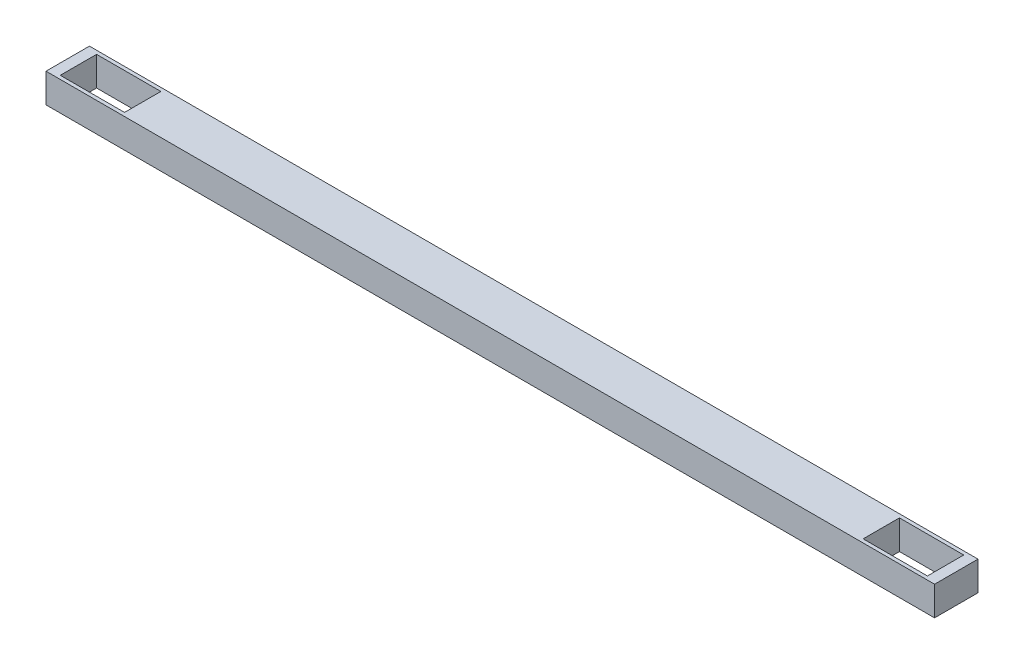
ISO-10303-21;
HEADER;
FILE_DESCRIPTION(('STEP AP214'),'2;1');
FILE_NAME('part.step','',(''),(''),'','','');
FILE_SCHEMA(('AUTOMOTIVE_DESIGN { 1 0 10303 214 1 1 1 1 }'));
ENDSEC;
DATA;
#1=APPLICATION_CONTEXT('core data for automotive mechanical design processes');
#2=APPLICATION_PROTOCOL_DEFINITION('international standard','automotive_design',2000,#1);
#3=PRODUCT_CONTEXT('',#1,'mechanical');
#4=PRODUCT('Part','Part','',(#3));
#5=PRODUCT_RELATED_PRODUCT_CATEGORY('part','',(#4));
#6=PRODUCT_DEFINITION_FORMATION('','',#4);
#7=PRODUCT_DEFINITION_CONTEXT('part definition',#1,'design');
#8=PRODUCT_DEFINITION('design','',#6,#7);
#9=PRODUCT_DEFINITION_SHAPE('','',#8);
#10=(LENGTH_UNIT() NAMED_UNIT(*) SI_UNIT(.MILLI.,.METRE.));
#11=(NAMED_UNIT(*) PLANE_ANGLE_UNIT() SI_UNIT($,.RADIAN.));
#12=(NAMED_UNIT(*) SI_UNIT($,.STERADIAN.) SOLID_ANGLE_UNIT());
#13=UNCERTAINTY_MEASURE_WITH_UNIT(LENGTH_MEASURE(1.E-05),#10,'distance_accuracy_value','');
#14=(GEOMETRIC_REPRESENTATION_CONTEXT(3) GLOBAL_UNCERTAINTY_ASSIGNED_CONTEXT((#13)) GLOBAL_UNIT_ASSIGNED_CONTEXT((#10,
#11,#12)) REPRESENTATION_CONTEXT('',''));
#15=CARTESIAN_POINT('',(0.,0.,0.));
#16=DIRECTION('',(0.,0.,1.));
#17=DIRECTION('',(1.,0.,0.));
#18=AXIS2_PLACEMENT_3D('',#15,#16,#17);
#19=CARTESIAN_POINT('',(0.,360.235,0.));
#20=DIRECTION('',(0.,1.,0.));
#21=DIRECTION('',(0.,0.,1.));
#22=AXIS2_PLACEMENT_3D('',#19,#20,#21);
#23=PLANE('',#22);
#24=DIRECTION('',(0.,0.,-1.));
#25=VECTOR('',#24,1.);
#26=CARTESIAN_POINT('',(311.625,360.235,-26.7500000000001));
#27=LINE('',#26,#25);
#28=CARTESIAN_POINT('',(311.625,360.235,-26.7500000000001));
#29=VERTEX_POINT('',#28);
#30=CARTESIAN_POINT('',(311.625,360.235,-57.2200000000001));
#31=VERTEX_POINT('',#30);
#32=EDGE_CURVE('E192',#29,#31,#27,.T.);
#33=ORIENTED_EDGE('',*,*,#32,.T.);
#34=DIRECTION('',(-1.,0.,0.));
#35=VECTOR('',#34,1.);
#36=CARTESIAN_POINT('',(311.625,360.235,-57.2200000000001));
#37=LINE('',#36,#35);
#38=CARTESIAN_POINT('',(-311.625,360.235,-57.22));
#39=VERTEX_POINT('',#38);
#40=EDGE_CURVE('E195',#31,#39,#37,.T.);
#41=ORIENTED_EDGE('',*,*,#40,.T.);
#42=DIRECTION('',(0.,0.,1.));
#43=VECTOR('',#42,1.);
#44=CARTESIAN_POINT('',(-311.625,360.235,-26.75));
#45=LINE('',#44,#43);
#46=CARTESIAN_POINT('',(-311.625,360.235,-26.75));
#47=VERTEX_POINT('',#46);
#48=EDGE_CURVE('E198',#39,#47,#45,.T.);
#49=ORIENTED_EDGE('',*,*,#48,.T.);
#50=DIRECTION('',(1.,0.,0.));
#51=VECTOR('',#50,1.);
#52=CARTESIAN_POINT('',(311.625,360.235,-26.7500000000001));
#53=LINE('',#52,#51);
#54=EDGE_CURVE('E200',#47,#29,#53,.T.);
#55=ORIENTED_EDGE('',*,*,#54,.T.);
#56=EDGE_LOOP('',(#33,#41,#49,#55));
#57=FACE_BOUND('',#56,.T.);
#58=DIRECTION('',(1.,0.,0.));
#59=VECTOR('',#58,1.);
#60=CARTESIAN_POINT('',(304.125,360.235,-29.2500000000002));
#61=LINE('',#60,#59);
#62=CARTESIAN_POINT('',(259.025,360.235,-29.2500000000002));
#63=VERTEX_POINT('',#62);
#64=CARTESIAN_POINT('',(304.125,360.235,-29.2500000000002));
#65=VERTEX_POINT('',#64);
#66=EDGE_CURVE('E163',#63,#65,#61,.T.);
#67=ORIENTED_EDGE('',*,*,#66,.F.);
#68=DIRECTION('',(0.,0.,1.));
#69=VECTOR('',#68,1.);
#70=CARTESIAN_POINT('',(259.025,360.235,-54.72));
#71=LINE('',#70,#69);
#72=CARTESIAN_POINT('',(259.025,360.235,-54.72));
#73=VERTEX_POINT('',#72);
#74=EDGE_CURVE('E161',#73,#63,#71,.T.);
#75=ORIENTED_EDGE('',*,*,#74,.F.);
#76=DIRECTION('',(-1.,0.,0.));
#77=VECTOR('',#76,1.);
#78=CARTESIAN_POINT('',(304.125,360.235,-54.72));
#79=LINE('',#78,#77);
#80=CARTESIAN_POINT('',(304.125,360.235,-54.72));
#81=VERTEX_POINT('',#80);
#82=EDGE_CURVE('E169',#81,#73,#79,.T.);
#83=ORIENTED_EDGE('',*,*,#82,.F.);
#84=DIRECTION('',(0.,0.,-1.));
#85=VECTOR('',#84,1.);
#86=CARTESIAN_POINT('',(304.125,360.235,-54.72));
#87=LINE('',#86,#85);
#88=EDGE_CURVE('E166',#65,#81,#87,.T.);
#89=ORIENTED_EDGE('',*,*,#88,.F.);
#90=EDGE_LOOP('',(#67,#75,#83,#89));
#91=FACE_BOUND('',#90,.T.);
#92=DIRECTION('',(1.,0.,0.));
#93=VECTOR('',#92,1.);
#94=CARTESIAN_POINT('',(-259.025,360.235,-29.2500000000001));
#95=LINE('',#94,#93);
#96=CARTESIAN_POINT('',(-304.125,360.235,-29.25));
#97=VERTEX_POINT('',#96);
#98=CARTESIAN_POINT('',(-259.025,360.235,-29.2500000000001));
#99=VERTEX_POINT('',#98);
#100=EDGE_CURVE('E133',#97,#99,#95,.T.);
#101=ORIENTED_EDGE('',*,*,#100,.F.);
#102=DIRECTION('',(0.,0.,1.));
#103=VECTOR('',#102,1.);
#104=CARTESIAN_POINT('',(-304.125,360.235,-29.25));
#105=LINE('',#104,#103);
#106=CARTESIAN_POINT('',(-304.125,360.235,-54.7199999999999));
#107=VERTEX_POINT('',#106);
#108=EDGE_CURVE('E125',#107,#97,#105,.T.);
#109=ORIENTED_EDGE('',*,*,#108,.F.);
#110=DIRECTION('',(-1.,0.,0.));
#111=VECTOR('',#110,1.);
#112=CARTESIAN_POINT('',(-259.025,360.235,-54.7199999999999));
#113=LINE('',#112,#111);
#114=CARTESIAN_POINT('',(-259.025,360.235,-54.7199999999999));
#115=VERTEX_POINT('',#114);
#116=EDGE_CURVE('E147',#115,#107,#113,.T.);
#117=ORIENTED_EDGE('',*,*,#116,.F.);
#118=DIRECTION('',(0.,0.,-1.));
#119=VECTOR('',#118,1.);
#120=CARTESIAN_POINT('',(-259.025,360.235,-29.2500000000001));
#121=LINE('',#120,#119);
#122=EDGE_CURVE('E145',#99,#115,#121,.T.);
#123=ORIENTED_EDGE('',*,*,#122,.F.);
#124=EDGE_LOOP('',(#101,#109,#117,#123));
#125=FACE_BOUND('',#124,.T.);
#126=ADVANCED_FACE('F36',(#57,#91,#125),#23,.T.);
#127=CARTESIAN_POINT('',(0.,339.765,0.));
#128=DIRECTION('',(0.,1.,0.));
#129=DIRECTION('',(0.,0.,1.));
#130=AXIS2_PLACEMENT_3D('',#127,#128,#129);
#131=PLANE('',#130);
#132=DIRECTION('',(0.,0.,1.));
#133=VECTOR('',#132,1.);
#134=CARTESIAN_POINT('',(259.025,339.765,-54.72));
#135=LINE('',#134,#133);
#136=CARTESIAN_POINT('',(259.025,339.765,-54.72));
#137=VERTEX_POINT('',#136);
#138=CARTESIAN_POINT('',(259.025,339.765,-29.2500000000002));
#139=VERTEX_POINT('',#138);
#140=EDGE_CURVE('E141',#137,#139,#135,.T.);
#141=ORIENTED_EDGE('',*,*,#140,.T.);
#142=DIRECTION('',(1.,0.,0.));
#143=VECTOR('',#142,1.);
#144=CARTESIAN_POINT('',(304.125,339.765,-29.2500000000002));
#145=LINE('',#144,#143);
#146=CARTESIAN_POINT('',(304.125,339.765,-29.2500000000002));
#147=VERTEX_POINT('',#146);
#148=EDGE_CURVE('E174',#139,#147,#145,.T.);
#149=ORIENTED_EDGE('',*,*,#148,.T.);
#150=DIRECTION('',(0.,0.,-1.));
#151=VECTOR('',#150,1.);
#152=CARTESIAN_POINT('',(304.125,339.765,-54.72));
#153=LINE('',#152,#151);
#154=CARTESIAN_POINT('',(304.125,339.765,-54.72));
#155=VERTEX_POINT('',#154);
#156=EDGE_CURVE('E177',#147,#155,#153,.T.);
#157=ORIENTED_EDGE('',*,*,#156,.T.);
#158=DIRECTION('',(-1.,0.,0.));
#159=VECTOR('',#158,1.);
#160=CARTESIAN_POINT('',(304.125,339.765,-54.72));
#161=LINE('',#160,#159);
#162=EDGE_CURVE('E164',#155,#137,#161,.T.);
#163=ORIENTED_EDGE('',*,*,#162,.T.);
#164=EDGE_LOOP('',(#141,#149,#157,#163));
#165=FACE_BOUND('',#164,.T.);
#166=DIRECTION('',(0.,0.,-1.));
#167=VECTOR('',#166,1.);
#168=CARTESIAN_POINT('',(311.625,339.765,-26.7500000000001));
#169=LINE('',#168,#167);
#170=CARTESIAN_POINT('',(311.625,339.765,-26.7500000000001));
#171=VERTEX_POINT('',#170);
#172=CARTESIAN_POINT('',(311.625,339.765,-57.2200000000001));
#173=VERTEX_POINT('',#172);
#174=EDGE_CURVE('E191',#171,#173,#169,.T.);
#175=ORIENTED_EDGE('',*,*,#174,.F.);
#176=DIRECTION('',(1.,0.,0.));
#177=VECTOR('',#176,1.);
#178=CARTESIAN_POINT('',(311.625,339.765,-26.7500000000001));
#179=LINE('',#178,#177);
#180=CARTESIAN_POINT('',(-311.625,339.765,-26.75));
#181=VERTEX_POINT('',#180);
#182=EDGE_CURVE('E196',#181,#171,#179,.T.);
#183=ORIENTED_EDGE('',*,*,#182,.F.);
#184=DIRECTION('',(0.,0.,1.));
#185=VECTOR('',#184,1.);
#186=CARTESIAN_POINT('',(-311.625,339.765,-26.75));
#187=LINE('',#186,#185);
#188=CARTESIAN_POINT('',(-311.625,339.765,-57.22));
#189=VERTEX_POINT('',#188);
#190=EDGE_CURVE('E207',#189,#181,#187,.T.);
#191=ORIENTED_EDGE('',*,*,#190,.F.);
#192=DIRECTION('',(-1.,0.,0.));
#193=VECTOR('',#192,1.);
#194=CARTESIAN_POINT('',(311.625,339.765,-57.2200000000001));
#195=LINE('',#194,#193);
#196=EDGE_CURVE('E205',#173,#189,#195,.T.);
#197=ORIENTED_EDGE('',*,*,#196,.F.);
#198=EDGE_LOOP('',(#175,#183,#191,#197));
#199=FACE_BOUND('',#198,.T.);
#200=DIRECTION('',(0.,0.,1.));
#201=VECTOR('',#200,1.);
#202=CARTESIAN_POINT('',(-304.125,339.765,-29.25));
#203=LINE('',#202,#201);
#204=CARTESIAN_POINT('',(-304.125,339.765,-54.7199999999999));
#205=VERTEX_POINT('',#204);
#206=CARTESIAN_POINT('',(-304.125,339.765,-29.25));
#207=VERTEX_POINT('',#206);
#208=EDGE_CURVE('E59',#205,#207,#203,.T.);
#209=ORIENTED_EDGE('',*,*,#208,.T.);
#210=DIRECTION('',(1.,0.,0.));
#211=VECTOR('',#210,1.);
#212=CARTESIAN_POINT('',(-259.025,339.765,-29.2500000000001));
#213=LINE('',#212,#211);
#214=CARTESIAN_POINT('',(-259.025,339.765,-29.2500000000001));
#215=VERTEX_POINT('',#214);
#216=EDGE_CURVE('E140',#207,#215,#213,.T.);
#217=ORIENTED_EDGE('',*,*,#216,.T.);
#218=DIRECTION('',(0.,0.,-1.));
#219=VECTOR('',#218,1.);
#220=CARTESIAN_POINT('',(-259.025,339.765,-29.2500000000001));
#221=LINE('',#220,#219);
#222=CARTESIAN_POINT('',(-259.025,339.765,-54.7199999999999));
#223=VERTEX_POINT('',#222);
#224=EDGE_CURVE('E153',#215,#223,#221,.T.);
#225=ORIENTED_EDGE('',*,*,#224,.T.);
#226=DIRECTION('',(-1.,0.,0.));
#227=VECTOR('',#226,1.);
#228=CARTESIAN_POINT('',(-259.025,339.765,-54.7199999999999));
#229=LINE('',#228,#227);
#230=EDGE_CURVE('E134',#223,#205,#229,.T.);
#231=ORIENTED_EDGE('',*,*,#230,.T.);
#232=EDGE_LOOP('',(#209,#217,#225,#231));
#233=FACE_BOUND('',#232,.T.);
#234=ADVANCED_FACE('F225',(#165,#199,#233),#131,.F.);
#235=CARTESIAN_POINT('',(311.625,360.235,-26.7500000000001));
#236=DIRECTION('',(-1.,0.,0.));
#237=DIRECTION('',(0.,0.,1.));
#238=AXIS2_PLACEMENT_3D('',#235,#236,#237);
#239=PLANE('',#238);
#240=ORIENTED_EDGE('',*,*,#174,.T.);
#241=DIRECTION('',(0.,-1.,0.));
#242=VECTOR('',#241,1.);
#243=CARTESIAN_POINT('',(311.625,360.235,-57.2200000000001));
#244=LINE('',#243,#242);
#245=EDGE_CURVE('E11',#31,#173,#244,.T.);
#246=ORIENTED_EDGE('',*,*,#245,.F.);
#247=ORIENTED_EDGE('',*,*,#32,.F.);
#248=DIRECTION('',(0.,-1.,0.));
#249=VECTOR('',#248,1.);
#250=CARTESIAN_POINT('',(311.625,360.235,-26.7500000000001));
#251=LINE('',#250,#249);
#252=EDGE_CURVE('E202',#29,#171,#251,.T.);
#253=ORIENTED_EDGE('',*,*,#252,.T.);
#254=EDGE_LOOP('',(#240,#246,#247,#253));
#255=FACE_BOUND('',#254,.T.);
#256=ADVANCED_FACE('F38',(#255),#239,.F.);
#257=CARTESIAN_POINT('',(311.625,360.235,-57.2200000000001));
#258=DIRECTION('',(0.,0.,1.));
#259=DIRECTION('',(1.,0.,0.));
#260=AXIS2_PLACEMENT_3D('',#257,#258,#259);
#261=PLANE('',#260);
#262=ORIENTED_EDGE('',*,*,#196,.T.);
#263=DIRECTION('',(0.,-1.,0.));
#264=VECTOR('',#263,1.);
#265=CARTESIAN_POINT('',(-311.625,360.235,-57.22));
#266=LINE('',#265,#264);
#267=EDGE_CURVE('E44',#39,#189,#266,.T.);
#268=ORIENTED_EDGE('',*,*,#267,.F.);
#269=ORIENTED_EDGE('',*,*,#40,.F.);
#270=ORIENTED_EDGE('',*,*,#245,.T.);
#271=EDGE_LOOP('',(#262,#268,#269,#270));
#272=FACE_BOUND('',#271,.T.);
#273=ADVANCED_FACE('F236',(#272),#261,.F.);
#274=CARTESIAN_POINT('',(-311.625,360.235,-26.75));
#275=DIRECTION('',(1.,0.,0.));
#276=DIRECTION('',(0.,0.,-1.));
#277=AXIS2_PLACEMENT_3D('',#274,#275,#276);
#278=PLANE('',#277);
#279=ORIENTED_EDGE('',*,*,#190,.T.);
#280=DIRECTION('',(0.,-1.,0.));
#281=VECTOR('',#280,1.);
#282=CARTESIAN_POINT('',(-311.625,360.235,-26.75));
#283=LINE('',#282,#281);
#284=EDGE_CURVE('E212',#47,#181,#283,.T.);
#285=ORIENTED_EDGE('',*,*,#284,.F.);
#286=ORIENTED_EDGE('',*,*,#48,.F.);
#287=ORIENTED_EDGE('',*,*,#267,.T.);
#288=EDGE_LOOP('',(#279,#285,#286,#287));
#289=FACE_BOUND('',#288,.T.);
#290=ADVANCED_FACE('F219',(#289),#278,.F.);
#291=CARTESIAN_POINT('',(311.625,360.235,-26.7500000000001));
#292=DIRECTION('',(0.,0.,-1.));
#293=DIRECTION('',(-1.,0.,0.));
#294=AXIS2_PLACEMENT_3D('',#291,#292,#293);
#295=PLANE('',#294);
#296=ORIENTED_EDGE('',*,*,#182,.T.);
#297=ORIENTED_EDGE('',*,*,#252,.F.);
#298=ORIENTED_EDGE('',*,*,#54,.F.);
#299=ORIENTED_EDGE('',*,*,#284,.T.);
#300=EDGE_LOOP('',(#296,#297,#298,#299));
#301=FACE_BOUND('',#300,.T.);
#302=ADVANCED_FACE('F229',(#301),#295,.F.);
#303=CARTESIAN_POINT('',(259.025,360.235,-54.72));
#304=DIRECTION('',(1.,0.,0.));
#305=DIRECTION('',(0.,0.,-1.));
#306=AXIS2_PLACEMENT_3D('',#303,#304,#305);
#307=PLANE('',#306);
#308=ORIENTED_EDGE('',*,*,#140,.F.);
#309=DIRECTION('',(0.,-1.,0.));
#310=VECTOR('',#309,1.);
#311=CARTESIAN_POINT('',(259.025,360.235,-54.72));
#312=LINE('',#311,#310);
#313=EDGE_CURVE('E171',#73,#137,#312,.T.);
#314=ORIENTED_EDGE('',*,*,#313,.F.);
#315=ORIENTED_EDGE('',*,*,#74,.T.);
#316=DIRECTION('',(0.,-1.,0.));
#317=VECTOR('',#316,1.);
#318=CARTESIAN_POINT('',(259.025,360.235,-29.2500000000002));
#319=LINE('',#318,#317);
#320=EDGE_CURVE('E188',#63,#139,#319,.T.);
#321=ORIENTED_EDGE('',*,*,#320,.T.);
#322=EDGE_LOOP('',(#308,#314,#315,#321));
#323=FACE_BOUND('',#322,.T.);
#324=ADVANCED_FACE('F251',(#323),#307,.T.);
#325=CARTESIAN_POINT('',(304.125,360.235,-29.2500000000002));
#326=DIRECTION('',(0.,0.,-1.));
#327=DIRECTION('',(-1.,0.,0.));
#328=AXIS2_PLACEMENT_3D('',#325,#326,#327);
#329=PLANE('',#328);
#330=ORIENTED_EDGE('',*,*,#148,.F.);
#331=ORIENTED_EDGE('',*,*,#320,.F.);
#332=ORIENTED_EDGE('',*,*,#66,.T.);
#333=DIRECTION('',(0.,-1.,0.));
#334=VECTOR('',#333,1.);
#335=CARTESIAN_POINT('',(304.125,360.235,-29.2500000000002));
#336=LINE('',#335,#334);
#337=EDGE_CURVE('E186',#65,#147,#336,.T.);
#338=ORIENTED_EDGE('',*,*,#337,.T.);
#339=EDGE_LOOP('',(#330,#331,#332,#338));
#340=FACE_BOUND('',#339,.T.);
#341=ADVANCED_FACE('F258',(#340),#329,.T.);
#342=CARTESIAN_POINT('',(304.125,360.235,-54.72));
#343=DIRECTION('',(-1.,0.,0.));
#344=DIRECTION('',(0.,0.,1.));
#345=AXIS2_PLACEMENT_3D('',#342,#343,#344);
#346=PLANE('',#345);
#347=ORIENTED_EDGE('',*,*,#156,.F.);
#348=ORIENTED_EDGE('',*,*,#337,.F.);
#349=ORIENTED_EDGE('',*,*,#88,.T.);
#350=DIRECTION('',(0.,-1.,0.));
#351=VECTOR('',#350,1.);
#352=CARTESIAN_POINT('',(304.125,360.235,-54.72));
#353=LINE('',#352,#351);
#354=EDGE_CURVE('E184',#81,#155,#353,.T.);
#355=ORIENTED_EDGE('',*,*,#354,.T.);
#356=EDGE_LOOP('',(#347,#348,#349,#355));
#357=FACE_BOUND('',#356,.T.);
#358=ADVANCED_FACE('F263',(#357),#346,.T.);
#359=CARTESIAN_POINT('',(304.125,360.235,-54.72));
#360=DIRECTION('',(0.,0.,1.));
#361=DIRECTION('',(1.,0.,0.));
#362=AXIS2_PLACEMENT_3D('',#359,#360,#361);
#363=PLANE('',#362);
#364=ORIENTED_EDGE('',*,*,#162,.F.);
#365=ORIENTED_EDGE('',*,*,#354,.F.);
#366=ORIENTED_EDGE('',*,*,#82,.T.);
#367=ORIENTED_EDGE('',*,*,#313,.T.);
#368=EDGE_LOOP('',(#364,#365,#366,#367));
#369=FACE_BOUND('',#368,.T.);
#370=ADVANCED_FACE('F270',(#369),#363,.T.);
#371=CARTESIAN_POINT('',(-304.125,360.235,-29.25));
#372=DIRECTION('',(1.,0.,0.));
#373=DIRECTION('',(0.,0.,-1.));
#374=AXIS2_PLACEMENT_3D('',#371,#372,#373);
#375=PLANE('',#374);
#376=ORIENTED_EDGE('',*,*,#208,.F.);
#377=DIRECTION('',(0.,-1.,0.));
#378=VECTOR('',#377,1.);
#379=CARTESIAN_POINT('',(-304.125,360.235,-54.7199999999999));
#380=LINE('',#379,#378);
#381=EDGE_CURVE('E129',#107,#205,#380,.T.);
#382=ORIENTED_EDGE('',*,*,#381,.F.);
#383=ORIENTED_EDGE('',*,*,#108,.T.);
#384=DIRECTION('',(0.,-1.,0.));
#385=VECTOR('',#384,1.);
#386=CARTESIAN_POINT('',(-304.125,360.235,-29.25));
#387=LINE('',#386,#385);
#388=EDGE_CURVE('E128',#97,#207,#387,.T.);
#389=ORIENTED_EDGE('',*,*,#388,.T.);
#390=EDGE_LOOP('',(#376,#382,#383,#389));
#391=FACE_BOUND('',#390,.T.);
#392=ADVANCED_FACE('F127',(#391),#375,.T.);
#393=CARTESIAN_POINT('',(-259.025,360.235,-29.2500000000001));
#394=DIRECTION('',(0.,0.,-1.));
#395=DIRECTION('',(-1.,0.,0.));
#396=AXIS2_PLACEMENT_3D('',#393,#394,#395);
#397=PLANE('',#396);
#398=ORIENTED_EDGE('',*,*,#216,.F.);
#399=ORIENTED_EDGE('',*,*,#388,.F.);
#400=ORIENTED_EDGE('',*,*,#100,.T.);
#401=DIRECTION('',(0.,-1.,0.));
#402=VECTOR('',#401,1.);
#403=CARTESIAN_POINT('',(-259.025,360.235,-29.2500000000001));
#404=LINE('',#403,#402);
#405=EDGE_CURVE('E142',#99,#215,#404,.T.);
#406=ORIENTED_EDGE('',*,*,#405,.T.);
#407=EDGE_LOOP('',(#398,#399,#400,#406));
#408=FACE_BOUND('',#407,.T.);
#409=ADVANCED_FACE('F137',(#408),#397,.T.);
#410=CARTESIAN_POINT('',(-259.025,360.235,-29.2500000000001));
#411=DIRECTION('',(-1.,0.,0.));
#412=DIRECTION('',(0.,0.,1.));
#413=AXIS2_PLACEMENT_3D('',#410,#411,#412);
#414=PLANE('',#413);
#415=ORIENTED_EDGE('',*,*,#224,.F.);
#416=ORIENTED_EDGE('',*,*,#405,.F.);
#417=ORIENTED_EDGE('',*,*,#122,.T.);
#418=DIRECTION('',(0.,-1.,0.));
#419=VECTOR('',#418,1.);
#420=CARTESIAN_POINT('',(-259.025,360.235,-54.7199999999999));
#421=LINE('',#420,#419);
#422=EDGE_CURVE('E51',#115,#223,#421,.T.);
#423=ORIENTED_EDGE('',*,*,#422,.T.);
#424=EDGE_LOOP('',(#415,#416,#417,#423));
#425=FACE_BOUND('',#424,.T.);
#426=ADVANCED_FACE('F288',(#425),#414,.T.);
#427=CARTESIAN_POINT('',(-259.025,360.235,-54.7199999999999));
#428=DIRECTION('',(0.,0.,1.));
#429=DIRECTION('',(1.,0.,0.));
#430=AXIS2_PLACEMENT_3D('',#427,#428,#429);
#431=PLANE('',#430);
#432=ORIENTED_EDGE('',*,*,#230,.F.);
#433=ORIENTED_EDGE('',*,*,#422,.F.);
#434=ORIENTED_EDGE('',*,*,#116,.T.);
#435=ORIENTED_EDGE('',*,*,#381,.T.);
#436=EDGE_LOOP('',(#432,#433,#434,#435));
#437=FACE_BOUND('',#436,.T.);
#438=ADVANCED_FACE('F291',(#437),#431,.T.);
#439=CLOSED_SHELL('',(#126,#234,#256,#273,#290,#302,#324,#341,#358,#370,#392,#409,#426,#438));
#440=MANIFOLD_SOLID_BREP('B2',#439);
#441=ADVANCED_BREP_SHAPE_REPRESENTATION('',(#18,#440),#14);
#442=SHAPE_DEFINITION_REPRESENTATION(#9,#441);
ENDSEC;
END-ISO-10303-21;
